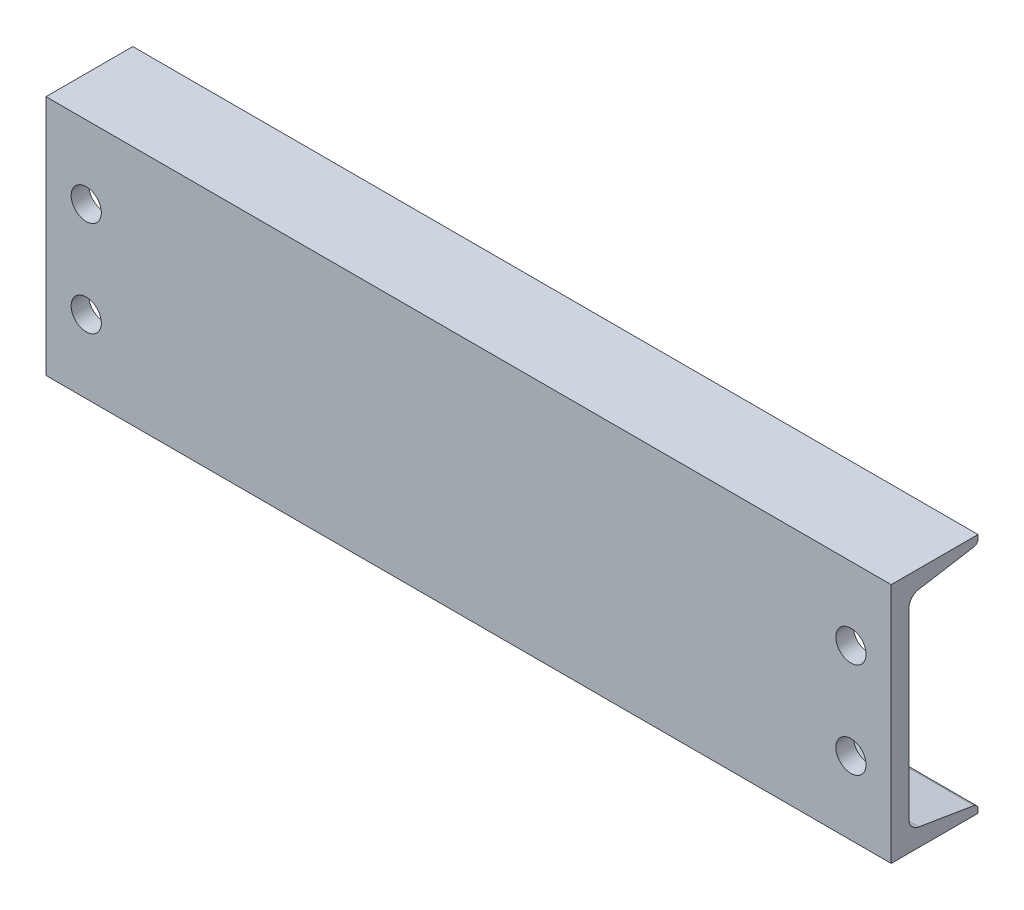
ISO-10303-21;
HEADER;
FILE_DESCRIPTION(('STEP AP214'),'2;1');
FILE_NAME('part.step','',(''),(''),'','','');
FILE_SCHEMA(('AUTOMOTIVE_DESIGN { 1 0 10303 214 1 1 1 1 }'));
ENDSEC;
DATA;
#1=APPLICATION_CONTEXT('core data for automotive mechanical design processes');
#2=APPLICATION_PROTOCOL_DEFINITION('international standard','automotive_design',2000,#1);
#3=PRODUCT_CONTEXT('',#1,'mechanical');
#4=PRODUCT('Part','Part','',(#3));
#5=PRODUCT_RELATED_PRODUCT_CATEGORY('part','',(#4));
#6=PRODUCT_DEFINITION_FORMATION('','',#4);
#7=PRODUCT_DEFINITION_CONTEXT('part definition',#1,'design');
#8=PRODUCT_DEFINITION('design','',#6,#7);
#9=PRODUCT_DEFINITION_SHAPE('','',#8);
#10=(LENGTH_UNIT() NAMED_UNIT(*) SI_UNIT(.MILLI.,.METRE.));
#11=(NAMED_UNIT(*) PLANE_ANGLE_UNIT() SI_UNIT($,.RADIAN.));
#12=(NAMED_UNIT(*) SI_UNIT($,.STERADIAN.) SOLID_ANGLE_UNIT());
#13=UNCERTAINTY_MEASURE_WITH_UNIT(LENGTH_MEASURE(1.E-05),#10,'distance_accuracy_value','');
#14=(GEOMETRIC_REPRESENTATION_CONTEXT(3) GLOBAL_UNCERTAINTY_ASSIGNED_CONTEXT((#13)) GLOBAL_UNIT_ASSIGNED_CONTEXT((#10,
#11,#12)) REPRESENTATION_CONTEXT('',''));
#15=CARTESIAN_POINT('',(0.,0.,0.));
#16=DIRECTION('',(0.,0.,1.));
#17=DIRECTION('',(1.,0.,0.));
#18=AXIS2_PLACEMENT_3D('',#15,#16,#17);
#19=CARTESIAN_POINT('',(266.7,-76.2,27.3939));
#20=DIRECTION('',(0.,1.,0.));
#21=DIRECTION('',(0.,0.,1.));
#22=AXIS2_PLACEMENT_3D('',#19,#20,#21);
#23=PLANE('',#22);
#24=CARTESIAN_POINT('',(152.4,-76.2,-10.7061));
#25=DIRECTION('',(0.,-1.,0.));
#26=DIRECTION('',(0.,0.,1.));
#27=AXIS2_PLACEMENT_3D('',#24,#25,#26);
#28=CIRCLE('',#27,9.525);
#29=CARTESIAN_POINT('',(152.4,-76.2,-1.1811));
#30=VERTEX_POINT('',#29);
#31=EDGE_CURVE('E252',#30,#30,#28,.T.);
#32=ORIENTED_EDGE('',*,*,#31,.F.);
#33=EDGE_LOOP('',(#32));
#34=FACE_BOUND('',#33,.T.);
#35=CARTESIAN_POINT('',(-152.4,-76.2,-10.7061));
#36=DIRECTION('',(0.,-1.,0.));
#37=DIRECTION('',(0.,0.,-1.));
#38=AXIS2_PLACEMENT_3D('',#35,#36,#37);
#39=CIRCLE('',#38,9.525);
#40=CARTESIAN_POINT('',(-152.4,-76.2,-20.2311));
#41=VERTEX_POINT('',#40);
#42=EDGE_CURVE('E255',#41,#41,#39,.T.);
#43=ORIENTED_EDGE('',*,*,#42,.F.);
#44=EDGE_LOOP('',(#43));
#45=FACE_BOUND('',#44,.T.);
#46=DIRECTION('',(0.,0.,-1.));
#47=VECTOR('',#46,1.);
#48=CARTESIAN_POINT('',(-266.7,-76.2,27.3939));
#49=LINE('',#48,#47);
#50=CARTESIAN_POINT('',(-266.7,-76.2,27.3939));
#51=VERTEX_POINT('',#50);
#52=CARTESIAN_POINT('',(-266.7,-76.2,-27.3939));
#53=VERTEX_POINT('',#52);
#54=EDGE_CURVE('E137',#51,#53,#49,.T.);
#55=ORIENTED_EDGE('',*,*,#54,.T.);
#56=DIRECTION('',(-1.,0.,0.));
#57=VECTOR('',#56,1.);
#58=CARTESIAN_POINT('',(266.7,-76.2,-27.3939));
#59=LINE('',#58,#57);
#60=CARTESIAN_POINT('',(266.7,-76.2,-27.3939));
#61=VERTEX_POINT('',#60);
#62=EDGE_CURVE('E11',#61,#53,#59,.T.);
#63=ORIENTED_EDGE('',*,*,#62,.F.);
#64=DIRECTION('',(0.,0.,-1.));
#65=VECTOR('',#64,1.);
#66=CARTESIAN_POINT('',(266.7,-76.2,27.3939));
#67=LINE('',#66,#65);
#68=CARTESIAN_POINT('',(266.7,-76.2,27.3939));
#69=VERTEX_POINT('',#68);
#70=EDGE_CURVE('E160',#69,#61,#67,.T.);
#71=ORIENTED_EDGE('',*,*,#70,.F.);
#72=DIRECTION('',(-1.,0.,0.));
#73=VECTOR('',#72,1.);
#74=CARTESIAN_POINT('',(266.7,-76.2,27.3939));
#75=LINE('',#74,#73);
#76=EDGE_CURVE('E133',#69,#51,#75,.T.);
#77=ORIENTED_EDGE('',*,*,#76,.T.);
#78=EDGE_LOOP('',(#55,#63,#71,#77));
#79=FACE_BOUND('',#78,.T.);
#80=ADVANCED_FACE('F17',(#34,#45,#79),#23,.F.);
#81=CARTESIAN_POINT('',(266.7,-76.2,-27.3939));
#82=DIRECTION('',(0.,0.,1.));
#83=DIRECTION('',(1.,0.,0.));
#84=AXIS2_PLACEMENT_3D('',#81,#82,#83);
#85=PLANE('',#84);
#86=DIRECTION('',(0.,1.,0.));
#87=VECTOR('',#86,1.);
#88=CARTESIAN_POINT('',(-266.7,-76.2,-27.3939));
#89=LINE('',#88,#87);
#90=CARTESIAN_POINT('',(-266.7,-73.7107446530364,-27.3939));
#91=VERTEX_POINT('',#90);
#92=EDGE_CURVE('E140',#53,#91,#89,.T.);
#93=ORIENTED_EDGE('',*,*,#92,.T.);
#94=DIRECTION('',(-1.,0.,0.));
#95=VECTOR('',#94,1.);
#96=CARTESIAN_POINT('',(266.7,-73.7107446530364,-27.3939));
#97=LINE('',#96,#95);
#98=CARTESIAN_POINT('',(266.7,-73.7107446530364,-27.3939));
#99=VERTEX_POINT('',#98);
#100=EDGE_CURVE('E25',#99,#91,#97,.T.);
#101=ORIENTED_EDGE('',*,*,#100,.F.);
#102=DIRECTION('',(0.,1.,0.));
#103=VECTOR('',#102,1.);
#104=CARTESIAN_POINT('',(266.7,-76.2,-27.3939));
#105=LINE('',#104,#103);
#106=EDGE_CURVE('E88',#61,#99,#105,.T.);
#107=ORIENTED_EDGE('',*,*,#106,.F.);
#108=ORIENTED_EDGE('',*,*,#62,.T.);
#109=EDGE_LOOP('',(#93,#101,#107,#108));
#110=FACE_BOUND('',#109,.T.);
#111=ADVANCED_FACE('F243',(#110),#85,.F.);
#112=CARTESIAN_POINT('',(266.7,-73.7107446530364,-24.3459));
#113=DIRECTION('',(-1.,0.,0.));
#114=DIRECTION('',(0.,0.,1.));
#115=AXIS2_PLACEMENT_3D('',#112,#113,#114);
#116=CYLINDRICAL_SURFACE('',#115,3.048);
#117=CARTESIAN_POINT('',(-266.7,-73.7107446530364,-24.3459));
#118=DIRECTION('',(1.,0.,0.));
#119=DIRECTION('',(0.,0.,-1.));
#120=AXIS2_PLACEMENT_3D('',#117,#118,#119);
#121=CIRCLE('',#120,3.048);
#122=CARTESIAN_POINT('',(-266.7,-70.7042219011292,-24.8470236796088));
#123=VERTEX_POINT('',#122);
#124=EDGE_CURVE('E143',#91,#123,#121,.T.);
#125=ORIENTED_EDGE('',*,*,#124,.T.);
#126=DIRECTION('',(-1.,0.,0.));
#127=VECTOR('',#126,1.);
#128=CARTESIAN_POINT('',(266.7,-70.7042219011292,-24.8470236796088));
#129=LINE('',#128,#127);
#130=CARTESIAN_POINT('',(266.7,-70.7042219011292,-24.8470236796088));
#131=VERTEX_POINT('',#130);
#132=EDGE_CURVE('E179',#131,#123,#129,.T.);
#133=ORIENTED_EDGE('',*,*,#132,.F.);
#134=CARTESIAN_POINT('',(266.7,-73.7107446530364,-24.3459));
#135=DIRECTION('',(1.,0.,0.));
#136=DIRECTION('',(0.,0.,-1.));
#137=AXIS2_PLACEMENT_3D('',#134,#135,#136);
#138=CIRCLE('',#137,3.048);
#139=EDGE_CURVE('E187',#99,#131,#138,.T.);
#140=ORIENTED_EDGE('',*,*,#139,.F.);
#141=ORIENTED_EDGE('',*,*,#100,.T.);
#142=EDGE_LOOP('',(#125,#133,#140,#141));
#143=FACE_BOUND('',#142,.T.);
#144=ADVANCED_FACE('F185',(#143),#116,.T.);
#145=CARTESIAN_POINT('',(266.7,-64.908143628462,9.92690919902199));
#146=DIRECTION('',(0.,-0.986391978972162,0.164410656039631));
#147=DIRECTION('',(0.,-0.164410656039631,-0.986391978972162));
#148=AXIS2_PLACEMENT_3D('',#145,#146,#147);
#149=PLANE('',#148);
#150=CARTESIAN_POINT('',(152.4,-68.3472293578672,-10.7061));
#151=DIRECTION('',(0.,-0.986391978972162,0.164410656039631));
#152=DIRECTION('',(0.,-0.164410656039631,-0.986391978972162));
#153=AXIS2_PLACEMENT_3D('',#150,#151,#152);
#154=ELLIPSE('',#153,9.65640455625482,9.525);
#155=CARTESIAN_POINT('',(152.4,-69.9348451659451,-20.2311));
#156=VERTEX_POINT('',#155);
#157=EDGE_CURVE('E258',#156,#156,#154,.F.);
#158=ORIENTED_EDGE('',*,*,#157,.F.);
#159=EDGE_LOOP('',(#158));
#160=FACE_BOUND('',#159,.T.);
#161=CARTESIAN_POINT('',(-152.4,-68.3472293578672,-10.7061));
#162=DIRECTION('',(0.,-0.986391978972162,0.164410656039631));
#163=DIRECTION('',(0.,-0.164410656039631,-0.986391978972162));
#164=AXIS2_PLACEMENT_3D('',#161,#162,#163);
#165=ELLIPSE('',#164,9.65640455625482,9.525);
#166=CARTESIAN_POINT('',(-152.4,-69.9348451659451,-20.2311));
#167=VERTEX_POINT('',#166);
#168=EDGE_CURVE('E257',#167,#167,#165,.F.);
#169=ORIENTED_EDGE('',*,*,#168,.F.);
#170=EDGE_LOOP('',(#169));
#171=FACE_BOUND('',#170,.T.);
#172=DIRECTION('',(0.,0.164410656039631,0.986391978972162));
#173=VECTOR('',#172,1.);
#174=CARTESIAN_POINT('',(-266.7,-64.908143628462,9.92690919902199));
#175=LINE('',#174,#173);
#176=CARTESIAN_POINT('',(-266.7,-64.908143628462,9.92690919902199));
#177=VERTEX_POINT('',#176);
#178=EDGE_CURVE('E145',#123,#177,#175,.T.);
#179=ORIENTED_EDGE('',*,*,#178,.T.);
#180=DIRECTION('',(-1.,0.,0.));
#181=VECTOR('',#180,1.);
#182=CARTESIAN_POINT('',(266.7,-64.908143628462,9.92690919902199));
#183=LINE('',#182,#181);
#184=CARTESIAN_POINT('',(266.7,-64.908143628462,9.92690919902199));
#185=VERTEX_POINT('',#184);
#186=EDGE_CURVE('E176',#185,#177,#183,.T.);
#187=ORIENTED_EDGE('',*,*,#186,.F.);
#188=DIRECTION('',(0.,0.164410656039631,0.986391978972162));
#189=VECTOR('',#188,1.);
#190=CARTESIAN_POINT('',(266.7,-64.908143628462,9.92690919902199));
#191=LINE('',#190,#189);
#192=EDGE_CURVE('E205',#131,#185,#191,.T.);
#193=ORIENTED_EDGE('',*,*,#192,.F.);
#194=ORIENTED_EDGE('',*,*,#132,.T.);
#195=EDGE_LOOP('',(#179,#187,#193,#194));
#196=FACE_BOUND('',#195,.T.);
#197=ADVANCED_FACE('F196',(#160,#171,#196),#149,.F.);
#198=CARTESIAN_POINT('',(266.7,-57.3918367486941,8.6741));
#199=DIRECTION('',(-1.,0.,0.));
#200=DIRECTION('',(0.,0.,1.));
#201=AXIS2_PLACEMENT_3D('',#198,#199,#200);
#202=CYLINDRICAL_SURFACE('',#201,7.62);
#203=CARTESIAN_POINT('',(-266.7,-57.3918367486941,8.6741));
#204=DIRECTION('',(-1.,0.,0.));
#205=DIRECTION('',(0.,0.,-1.));
#206=AXIS2_PLACEMENT_3D('',#203,#204,#205);
#207=CIRCLE('',#206,7.62);
#208=CARTESIAN_POINT('',(-266.7,-57.3918367486941,16.2941));
#209=VERTEX_POINT('',#208);
#210=EDGE_CURVE('E147',#177,#209,#207,.T.);
#211=ORIENTED_EDGE('',*,*,#210,.T.);
#212=DIRECTION('',(-1.,0.,0.));
#213=VECTOR('',#212,1.);
#214=CARTESIAN_POINT('',(266.7,-57.3918367486941,16.2941));
#215=LINE('',#214,#213);
#216=CARTESIAN_POINT('',(266.7,-57.3918367486941,16.2941));
#217=VERTEX_POINT('',#216);
#218=EDGE_CURVE('E173',#217,#209,#215,.T.);
#219=ORIENTED_EDGE('',*,*,#218,.F.);
#220=CARTESIAN_POINT('',(266.7,-57.3918367486941,8.6741));
#221=DIRECTION('',(-1.,0.,0.));
#222=DIRECTION('',(0.,0.,-1.));
#223=AXIS2_PLACEMENT_3D('',#220,#221,#222);
#224=CIRCLE('',#223,7.62);
#225=EDGE_CURVE('E202',#185,#217,#224,.T.);
#226=ORIENTED_EDGE('',*,*,#225,.F.);
#227=ORIENTED_EDGE('',*,*,#186,.T.);
#228=EDGE_LOOP('',(#211,#219,#226,#227));
#229=FACE_BOUND('',#228,.T.);
#230=ADVANCED_FACE('F200',(#229),#202,.F.);
#231=CARTESIAN_POINT('',(266.7,57.3918367486941,16.2941));
#232=DIRECTION('',(0.,0.,1.));
#233=DIRECTION('',(0.,-1.,0.));
#234=AXIS2_PLACEMENT_3D('',#231,#232,#233);
#235=PLANE('',#234);
#236=CARTESIAN_POINT('',(241.3,30.1625,16.2941));
#237=DIRECTION('',(0.,0.,1.));
#238=DIRECTION('',(0.,-1.,0.));
#239=AXIS2_PLACEMENT_3D('',#236,#237,#238);
#240=CIRCLE('',#239,9.525);
#241=CARTESIAN_POINT('',(241.3,20.6375,16.2941));
#242=VERTEX_POINT('',#241);
#243=EDGE_CURVE('E269',#242,#242,#240,.F.);
#244=ORIENTED_EDGE('',*,*,#243,.F.);
#245=EDGE_LOOP('',(#244));
#246=FACE_BOUND('',#245,.T.);
#247=CARTESIAN_POINT('',(241.3,-30.1625,16.2941));
#248=DIRECTION('',(0.,0.,1.));
#249=DIRECTION('',(0.,-1.,0.));
#250=AXIS2_PLACEMENT_3D('',#247,#248,#249);
#251=CIRCLE('',#250,9.525);
#252=CARTESIAN_POINT('',(241.3,-39.6875,16.2941));
#253=VERTEX_POINT('',#252);
#254=EDGE_CURVE('E275',#253,#253,#251,.F.);
#255=ORIENTED_EDGE('',*,*,#254,.F.);
#256=EDGE_LOOP('',(#255));
#257=FACE_BOUND('',#256,.T.);
#258=CARTESIAN_POINT('',(-241.3,-30.1625,16.2941));
#259=DIRECTION('',(0.,0.,1.));
#260=DIRECTION('',(0.,-1.,0.));
#261=AXIS2_PLACEMENT_3D('',#258,#259,#260);
#262=CIRCLE('',#261,9.525);
#263=CARTESIAN_POINT('',(-241.3,-39.6875,16.2941));
#264=VERTEX_POINT('',#263);
#265=EDGE_CURVE('E281',#264,#264,#262,.F.);
#266=ORIENTED_EDGE('',*,*,#265,.F.);
#267=EDGE_LOOP('',(#266));
#268=FACE_BOUND('',#267,.T.);
#269=CARTESIAN_POINT('',(-241.3,30.1625,16.2941));
#270=DIRECTION('',(0.,0.,1.));
#271=DIRECTION('',(0.,-1.,0.));
#272=AXIS2_PLACEMENT_3D('',#269,#270,#271);
#273=CIRCLE('',#272,9.525);
#274=CARTESIAN_POINT('',(-241.3,20.6375,16.2941));
#275=VERTEX_POINT('',#274);
#276=EDGE_CURVE('E141',#275,#275,#273,.F.);
#277=ORIENTED_EDGE('',*,*,#276,.F.);
#278=EDGE_LOOP('',(#277));
#279=FACE_BOUND('',#278,.T.);
#280=DIRECTION('',(0.,1.,0.));
#281=VECTOR('',#280,1.);
#282=CARTESIAN_POINT('',(-266.7,57.3918367486941,16.2941));
#283=LINE('',#282,#281);
#284=CARTESIAN_POINT('',(-266.7,57.3918367486941,16.2941));
#285=VERTEX_POINT('',#284);
#286=EDGE_CURVE('E149',#209,#285,#283,.T.);
#287=ORIENTED_EDGE('',*,*,#286,.T.);
#288=DIRECTION('',(-1.,0.,0.));
#289=VECTOR('',#288,1.);
#290=CARTESIAN_POINT('',(266.7,57.3918367486941,16.2941));
#291=LINE('',#290,#289);
#292=CARTESIAN_POINT('',(266.7,57.3918367486941,16.2941));
#293=VERTEX_POINT('',#292);
#294=EDGE_CURVE('E170',#293,#285,#291,.T.);
#295=ORIENTED_EDGE('',*,*,#294,.F.);
#296=DIRECTION('',(0.,1.,0.));
#297=VECTOR('',#296,1.);
#298=CARTESIAN_POINT('',(266.7,57.3918367486941,16.2941));
#299=LINE('',#298,#297);
#300=EDGE_CURVE('E204',#217,#293,#299,.T.);
#301=ORIENTED_EDGE('',*,*,#300,.F.);
#302=ORIENTED_EDGE('',*,*,#218,.T.);
#303=EDGE_LOOP('',(#287,#295,#301,#302));
#304=FACE_BOUND('',#303,.T.);
#305=ADVANCED_FACE('F294',(#246,#257,#268,#279,#304),#235,.F.);
#306=CARTESIAN_POINT('',(266.7,57.3918367486941,8.6741));
#307=DIRECTION('',(-1.,0.,0.));
#308=DIRECTION('',(0.,0.,1.));
#309=AXIS2_PLACEMENT_3D('',#306,#307,#308);
#310=CYLINDRICAL_SURFACE('',#309,7.62);
#311=CARTESIAN_POINT('',(-266.7,57.3918367486941,8.6741));
#312=DIRECTION('',(-1.,0.,0.));
#313=DIRECTION('',(0.,0.,1.));
#314=AXIS2_PLACEMENT_3D('',#311,#312,#313);
#315=CIRCLE('',#314,7.62);
#316=CARTESIAN_POINT('',(-266.7,64.908143628462,9.92690919902198));
#317=VERTEX_POINT('',#316);
#318=EDGE_CURVE('E151',#285,#317,#315,.T.);
#319=ORIENTED_EDGE('',*,*,#318,.T.);
#320=DIRECTION('',(-1.,0.,0.));
#321=VECTOR('',#320,1.);
#322=CARTESIAN_POINT('',(266.7,64.908143628462,9.92690919902198));
#323=LINE('',#322,#321);
#324=CARTESIAN_POINT('',(266.7,64.908143628462,9.92690919902198));
#325=VERTEX_POINT('',#324);
#326=EDGE_CURVE('E167',#325,#317,#323,.T.);
#327=ORIENTED_EDGE('',*,*,#326,.F.);
#328=CARTESIAN_POINT('',(266.7,57.3918367486941,8.6741));
#329=DIRECTION('',(-1.,0.,0.));
#330=DIRECTION('',(0.,0.,1.));
#331=AXIS2_PLACEMENT_3D('',#328,#329,#330);
#332=CIRCLE('',#331,7.62);
#333=EDGE_CURVE('E207',#293,#325,#332,.T.);
#334=ORIENTED_EDGE('',*,*,#333,.F.);
#335=ORIENTED_EDGE('',*,*,#294,.T.);
#336=EDGE_LOOP('',(#319,#327,#334,#335));
#337=FACE_BOUND('',#336,.T.);
#338=ADVANCED_FACE('F297',(#337),#310,.F.);
#339=CARTESIAN_POINT('',(266.7,64.908143628462,9.92690919902198));
#340=DIRECTION('',(0.,0.986391978972162,0.16441065603963));
#341=DIRECTION('',(0.,-0.16441065603963,0.986391978972162));
#342=AXIS2_PLACEMENT_3D('',#339,#340,#341);
#343=PLANE('',#342);
#344=DIRECTION('',(0.,0.16441065603963,-0.986391978972162));
#345=VECTOR('',#344,1.);
#346=CARTESIAN_POINT('',(-266.7,64.908143628462,9.92690919902198));
#347=LINE('',#346,#345);
#348=CARTESIAN_POINT('',(-266.7,70.7042219011292,-24.8470236796088));
#349=VERTEX_POINT('',#348);
#350=EDGE_CURVE('E153',#317,#349,#347,.T.);
#351=ORIENTED_EDGE('',*,*,#350,.T.);
#352=DIRECTION('',(-1.,0.,0.));
#353=VECTOR('',#352,1.);
#354=CARTESIAN_POINT('',(266.7,70.7042219011292,-24.8470236796088));
#355=LINE('',#354,#353);
#356=CARTESIAN_POINT('',(266.7,70.7042219011292,-24.8470236796088));
#357=VERTEX_POINT('',#356);
#358=EDGE_CURVE('E164',#357,#349,#355,.T.);
#359=ORIENTED_EDGE('',*,*,#358,.F.);
#360=DIRECTION('',(0.,0.16441065603963,-0.986391978972162));
#361=VECTOR('',#360,1.);
#362=CARTESIAN_POINT('',(266.7,64.908143628462,9.92690919902198));
#363=LINE('',#362,#361);
#364=EDGE_CURVE('E213',#325,#357,#363,.T.);
#365=ORIENTED_EDGE('',*,*,#364,.F.);
#366=ORIENTED_EDGE('',*,*,#326,.T.);
#367=EDGE_LOOP('',(#351,#359,#365,#366));
#368=FACE_BOUND('',#367,.T.);
#369=ADVANCED_FACE('F219',(#368),#343,.F.);
#370=CARTESIAN_POINT('',(266.7,73.7107446530364,-24.3459));
#371=DIRECTION('',(-1.,0.,0.));
#372=DIRECTION('',(0.,0.,1.));
#373=AXIS2_PLACEMENT_3D('',#370,#371,#372);
#374=CYLINDRICAL_SURFACE('',#373,3.048);
#375=CARTESIAN_POINT('',(-266.7,73.7107446530364,-24.3459));
#376=DIRECTION('',(1.,0.,0.));
#377=DIRECTION('',(0.,0.,1.));
#378=AXIS2_PLACEMENT_3D('',#375,#376,#377);
#379=CIRCLE('',#378,3.048);
#380=CARTESIAN_POINT('',(-266.7,73.7107446530364,-27.3939));
#381=VERTEX_POINT('',#380);
#382=EDGE_CURVE('E155',#349,#381,#379,.T.);
#383=ORIENTED_EDGE('',*,*,#382,.T.);
#384=DIRECTION('',(-1.,0.,0.));
#385=VECTOR('',#384,1.);
#386=CARTESIAN_POINT('',(266.7,73.7107446530364,-27.3939));
#387=LINE('',#386,#385);
#388=CARTESIAN_POINT('',(266.7,73.7107446530364,-27.3939));
#389=VERTEX_POINT('',#388);
#390=EDGE_CURVE('E128',#389,#381,#387,.T.);
#391=ORIENTED_EDGE('',*,*,#390,.F.);
#392=CARTESIAN_POINT('',(266.7,73.7107446530364,-24.3459));
#393=DIRECTION('',(1.,0.,0.));
#394=DIRECTION('',(0.,0.,1.));
#395=AXIS2_PLACEMENT_3D('',#392,#393,#394);
#396=CIRCLE('',#395,3.048);
#397=EDGE_CURVE('E119',#357,#389,#396,.T.);
#398=ORIENTED_EDGE('',*,*,#397,.F.);
#399=ORIENTED_EDGE('',*,*,#358,.T.);
#400=EDGE_LOOP('',(#383,#391,#398,#399));
#401=FACE_BOUND('',#400,.T.);
#402=ADVANCED_FACE('F223',(#401),#374,.T.);
#403=CARTESIAN_POINT('',(266.7,76.2,-27.3939));
#404=DIRECTION('',(0.,0.,1.));
#405=DIRECTION('',(0.,-1.,0.));
#406=AXIS2_PLACEMENT_3D('',#403,#404,#405);
#407=PLANE('',#406);
#408=DIRECTION('',(0.,1.,0.));
#409=VECTOR('',#408,1.);
#410=CARTESIAN_POINT('',(-266.7,76.2,-27.3939));
#411=LINE('',#410,#409);
#412=CARTESIAN_POINT('',(-266.7,76.2,-27.3939));
#413=VERTEX_POINT('',#412);
#414=EDGE_CURVE('E127',#381,#413,#411,.T.);
#415=ORIENTED_EDGE('',*,*,#414,.T.);
#416=DIRECTION('',(-1.,0.,0.));
#417=VECTOR('',#416,1.);
#418=CARTESIAN_POINT('',(266.7,76.2,-27.3939));
#419=LINE('',#418,#417);
#420=CARTESIAN_POINT('',(266.7,76.2,-27.3939));
#421=VERTEX_POINT('',#420);
#422=EDGE_CURVE('E124',#421,#413,#419,.T.);
#423=ORIENTED_EDGE('',*,*,#422,.F.);
#424=DIRECTION('',(0.,1.,0.));
#425=VECTOR('',#424,1.);
#426=CARTESIAN_POINT('',(266.7,76.2,-27.3939));
#427=LINE('',#426,#425);
#428=EDGE_CURVE('E113',#389,#421,#427,.T.);
#429=ORIENTED_EDGE('',*,*,#428,.F.);
#430=ORIENTED_EDGE('',*,*,#390,.T.);
#431=EDGE_LOOP('',(#415,#423,#429,#430));
#432=FACE_BOUND('',#431,.T.);
#433=ADVANCED_FACE('F125',(#432),#407,.F.);
#434=CARTESIAN_POINT('',(266.7,76.2,27.3939));
#435=DIRECTION('',(0.,-1.,0.));
#436=DIRECTION('',(0.,0.,-1.));
#437=AXIS2_PLACEMENT_3D('',#434,#435,#436);
#438=PLANE('',#437);
#439=DIRECTION('',(0.,0.,1.));
#440=VECTOR('',#439,1.);
#441=CARTESIAN_POINT('',(-266.7,76.2,27.3939));
#442=LINE('',#441,#440);
#443=CARTESIAN_POINT('',(-266.7,76.2,27.3939));
#444=VERTEX_POINT('',#443);
#445=EDGE_CURVE('E74',#413,#444,#442,.T.);
#446=ORIENTED_EDGE('',*,*,#445,.T.);
#447=DIRECTION('',(-1.,0.,0.));
#448=VECTOR('',#447,1.);
#449=CARTESIAN_POINT('',(266.7,76.2,27.3939));
#450=LINE('',#449,#448);
#451=CARTESIAN_POINT('',(266.7,76.2,27.3939));
#452=VERTEX_POINT('',#451);
#453=EDGE_CURVE('E129',#452,#444,#450,.T.);
#454=ORIENTED_EDGE('',*,*,#453,.F.);
#455=DIRECTION('',(0.,0.,1.));
#456=VECTOR('',#455,1.);
#457=CARTESIAN_POINT('',(266.7,76.2,27.3939));
#458=LINE('',#457,#456);
#459=EDGE_CURVE('E117',#421,#452,#458,.T.);
#460=ORIENTED_EDGE('',*,*,#459,.F.);
#461=ORIENTED_EDGE('',*,*,#422,.T.);
#462=EDGE_LOOP('',(#446,#454,#460,#461));
#463=FACE_BOUND('',#462,.T.);
#464=ADVANCED_FACE('F131',(#463),#438,.F.);
#465=CARTESIAN_POINT('',(266.7,-76.2,27.3939));
#466=DIRECTION('',(0.,0.,-1.));
#467=DIRECTION('',(-1.,0.,0.));
#468=AXIS2_PLACEMENT_3D('',#465,#466,#467);
#469=PLANE('',#468);
#470=CARTESIAN_POINT('',(241.3,30.1625,27.3939));
#471=DIRECTION('',(0.,0.,1.));
#472=DIRECTION('',(-1.,0.,0.));
#473=AXIS2_PLACEMENT_3D('',#470,#471,#472);
#474=CIRCLE('',#473,9.525);
#475=CARTESIAN_POINT('',(231.775,30.1625,27.3939));
#476=VERTEX_POINT('',#475);
#477=EDGE_CURVE('E261',#476,#476,#474,.T.);
#478=ORIENTED_EDGE('',*,*,#477,.F.);
#479=EDGE_LOOP('',(#478));
#480=FACE_BOUND('',#479,.T.);
#481=CARTESIAN_POINT('',(241.3,-30.1625,27.3939));
#482=DIRECTION('',(0.,0.,1.));
#483=DIRECTION('',(1.,0.,0.));
#484=AXIS2_PLACEMENT_3D('',#481,#482,#483);
#485=CIRCLE('',#484,9.525);
#486=CARTESIAN_POINT('',(250.825,-30.1625,27.3939));
#487=VERTEX_POINT('',#486);
#488=EDGE_CURVE('E272',#487,#487,#485,.T.);
#489=ORIENTED_EDGE('',*,*,#488,.F.);
#490=EDGE_LOOP('',(#489));
#491=FACE_BOUND('',#490,.T.);
#492=CARTESIAN_POINT('',(-241.3,-30.1625,27.3939));
#493=DIRECTION('',(0.,0.,1.));
#494=DIRECTION('',(-1.,0.,0.));
#495=AXIS2_PLACEMENT_3D('',#492,#493,#494);
#496=CIRCLE('',#495,9.525);
#497=CARTESIAN_POINT('',(-250.825,-30.1625,27.3939));
#498=VERTEX_POINT('',#497);
#499=EDGE_CURVE('E278',#498,#498,#496,.T.);
#500=ORIENTED_EDGE('',*,*,#499,.F.);
#501=EDGE_LOOP('',(#500));
#502=FACE_BOUND('',#501,.T.);
#503=CARTESIAN_POINT('',(-241.3,30.1625,27.3939));
#504=DIRECTION('',(0.,0.,1.));
#505=DIRECTION('',(1.,0.,0.));
#506=AXIS2_PLACEMENT_3D('',#503,#504,#505);
#507=CIRCLE('',#506,9.525);
#508=CARTESIAN_POINT('',(-231.775,30.1625,27.3939));
#509=VERTEX_POINT('',#508);
#510=EDGE_CURVE('E284',#509,#509,#507,.T.);
#511=ORIENTED_EDGE('',*,*,#510,.F.);
#512=EDGE_LOOP('',(#511));
#513=FACE_BOUND('',#512,.T.);
#514=DIRECTION('',(0.,-1.,0.));
#515=VECTOR('',#514,1.);
#516=CARTESIAN_POINT('',(-266.7,-76.2,27.3939));
#517=LINE('',#516,#515);
#518=EDGE_CURVE('E80',#444,#51,#517,.T.);
#519=ORIENTED_EDGE('',*,*,#518,.T.);
#520=ORIENTED_EDGE('',*,*,#76,.F.);
#521=DIRECTION('',(0.,-1.,0.));
#522=VECTOR('',#521,1.);
#523=CARTESIAN_POINT('',(266.7,-76.2,27.3939));
#524=LINE('',#523,#522);
#525=EDGE_CURVE('E33',#452,#69,#524,.T.);
#526=ORIENTED_EDGE('',*,*,#525,.F.);
#527=ORIENTED_EDGE('',*,*,#453,.T.);
#528=EDGE_LOOP('',(#519,#520,#526,#527));
#529=FACE_BOUND('',#528,.T.);
#530=ADVANCED_FACE('F227',(#480,#491,#502,#513,#529),#469,.F.);
#531=CARTESIAN_POINT('',(266.7,-73.7107446530364,-24.3459));
#532=DIRECTION('',(1.,0.,0.));
#533=DIRECTION('',(0.,0.,-1.));
#534=AXIS2_PLACEMENT_3D('',#531,#532,#533);
#535=PLANE('',#534);
#536=ORIENTED_EDGE('',*,*,#70,.T.);
#537=ORIENTED_EDGE('',*,*,#106,.T.);
#538=ORIENTED_EDGE('',*,*,#139,.T.);
#539=ORIENTED_EDGE('',*,*,#192,.T.);
#540=ORIENTED_EDGE('',*,*,#225,.T.);
#541=ORIENTED_EDGE('',*,*,#300,.T.);
#542=ORIENTED_EDGE('',*,*,#333,.T.);
#543=ORIENTED_EDGE('',*,*,#364,.T.);
#544=ORIENTED_EDGE('',*,*,#397,.T.);
#545=ORIENTED_EDGE('',*,*,#428,.T.);
#546=ORIENTED_EDGE('',*,*,#459,.T.);
#547=ORIENTED_EDGE('',*,*,#525,.T.);
#548=EDGE_LOOP('',(#536,#537,#538,#539,#540,#541,#542,#543,#544,#545,#546,#547));
#549=FACE_BOUND('',#548,.T.);
#550=ADVANCED_FACE('F115',(#549),#535,.T.);
#551=CARTESIAN_POINT('',(-266.7,-73.7107446530364,-24.3459));
#552=DIRECTION('',(1.,0.,0.));
#553=DIRECTION('',(0.,0.,-1.));
#554=AXIS2_PLACEMENT_3D('',#551,#552,#553);
#555=PLANE('',#554);
#556=ORIENTED_EDGE('',*,*,#54,.F.);
#557=ORIENTED_EDGE('',*,*,#518,.F.);
#558=ORIENTED_EDGE('',*,*,#445,.F.);
#559=ORIENTED_EDGE('',*,*,#414,.F.);
#560=ORIENTED_EDGE('',*,*,#382,.F.);
#561=ORIENTED_EDGE('',*,*,#350,.F.);
#562=ORIENTED_EDGE('',*,*,#318,.F.);
#563=ORIENTED_EDGE('',*,*,#286,.F.);
#564=ORIENTED_EDGE('',*,*,#210,.F.);
#565=ORIENTED_EDGE('',*,*,#178,.F.);
#566=ORIENTED_EDGE('',*,*,#124,.F.);
#567=ORIENTED_EDGE('',*,*,#92,.F.);
#568=EDGE_LOOP('',(#556,#557,#558,#559,#560,#561,#562,#563,#564,#565,#566,#567));
#569=FACE_BOUND('',#568,.T.);
#570=ADVANCED_FACE('F191',(#569),#555,.F.);
#571=CARTESIAN_POINT('',(-241.3,30.1625,-27.3949));
#572=DIRECTION('',(0.,0.,1.));
#573=DIRECTION('',(1.,0.,0.));
#574=AXIS2_PLACEMENT_3D('',#571,#572,#573);
#575=CYLINDRICAL_SURFACE('',#574,9.525);
#576=ORIENTED_EDGE('',*,*,#510,.T.);
#577=EDGE_LOOP('',(#576));
#578=FACE_BOUND('',#577,.T.);
#579=ORIENTED_EDGE('',*,*,#276,.T.);
#580=EDGE_LOOP('',(#579));
#581=FACE_BOUND('',#580,.T.);
#582=ADVANCED_FACE('F292',(#578,#581),#575,.F.);
#583=CARTESIAN_POINT('',(-241.3,-30.1625,-27.3949));
#584=DIRECTION('',(0.,0.,1.));
#585=DIRECTION('',(1.,0.,0.));
#586=AXIS2_PLACEMENT_3D('',#583,#584,#585);
#587=CYLINDRICAL_SURFACE('',#586,9.525);
#588=ORIENTED_EDGE('',*,*,#499,.T.);
#589=EDGE_LOOP('',(#588));
#590=FACE_BOUND('',#589,.T.);
#591=ORIENTED_EDGE('',*,*,#265,.T.);
#592=EDGE_LOOP('',(#591));
#593=FACE_BOUND('',#592,.T.);
#594=ADVANCED_FACE('F400',(#590,#593),#587,.F.);
#595=CARTESIAN_POINT('',(241.3,-30.1625,-27.3949));
#596=DIRECTION('',(0.,0.,1.));
#597=DIRECTION('',(1.,0.,0.));
#598=AXIS2_PLACEMENT_3D('',#595,#596,#597);
#599=CYLINDRICAL_SURFACE('',#598,9.525);
#600=ORIENTED_EDGE('',*,*,#488,.T.);
#601=EDGE_LOOP('',(#600));
#602=FACE_BOUND('',#601,.T.);
#603=ORIENTED_EDGE('',*,*,#254,.T.);
#604=EDGE_LOOP('',(#603));
#605=FACE_BOUND('',#604,.T.);
#606=ADVANCED_FACE('F410',(#602,#605),#599,.F.);
#607=CARTESIAN_POINT('',(241.3,30.1625,-27.3949));
#608=DIRECTION('',(0.,0.,1.));
#609=DIRECTION('',(1.,0.,0.));
#610=AXIS2_PLACEMENT_3D('',#607,#608,#609);
#611=CYLINDRICAL_SURFACE('',#610,9.525);
#612=ORIENTED_EDGE('',*,*,#477,.T.);
#613=EDGE_LOOP('',(#612));
#614=FACE_BOUND('',#613,.T.);
#615=ORIENTED_EDGE('',*,*,#243,.T.);
#616=EDGE_LOOP('',(#615));
#617=FACE_BOUND('',#616,.T.);
#618=ADVANCED_FACE('F420',(#614,#617),#611,.F.);
#619=CARTESIAN_POINT('',(-152.4,76.201,-10.7061));
#620=DIRECTION('',(0.,-1.,0.));
#621=DIRECTION('',(0.,0.,-1.));
#622=AXIS2_PLACEMENT_3D('',#619,#620,#621);
#623=CYLINDRICAL_SURFACE('',#622,9.525);
#624=ORIENTED_EDGE('',*,*,#42,.T.);
#625=EDGE_LOOP('',(#624));
#626=FACE_BOUND('',#625,.T.);
#627=ORIENTED_EDGE('',*,*,#168,.T.);
#628=EDGE_LOOP('',(#627));
#629=FACE_BOUND('',#628,.T.);
#630=ADVANCED_FACE('F430',(#626,#629),#623,.F.);
#631=CARTESIAN_POINT('',(152.4,76.201,-10.7061));
#632=DIRECTION('',(0.,-1.,0.));
#633=DIRECTION('',(0.,0.,-1.));
#634=AXIS2_PLACEMENT_3D('',#631,#632,#633);
#635=CYLINDRICAL_SURFACE('',#634,9.525);
#636=ORIENTED_EDGE('',*,*,#31,.T.);
#637=EDGE_LOOP('',(#636));
#638=FACE_BOUND('',#637,.T.);
#639=ORIENTED_EDGE('',*,*,#157,.T.);
#640=EDGE_LOOP('',(#639));
#641=FACE_BOUND('',#640,.T.);
#642=ADVANCED_FACE('F440',(#638,#641),#635,.F.);
#643=CLOSED_SHELL('',(#80,#111,#144,#197,#230,#305,#338,#369,#402,#433,#464,#530,#550,#570,#582,
#594,#606,#618,#630,#642));
#644=MANIFOLD_SOLID_BREP('B1',#643);
#645=ADVANCED_BREP_SHAPE_REPRESENTATION('',(#18,#644),#14);
#646=SHAPE_DEFINITION_REPRESENTATION(#9,#645);
ENDSEC;
END-ISO-10303-21;
